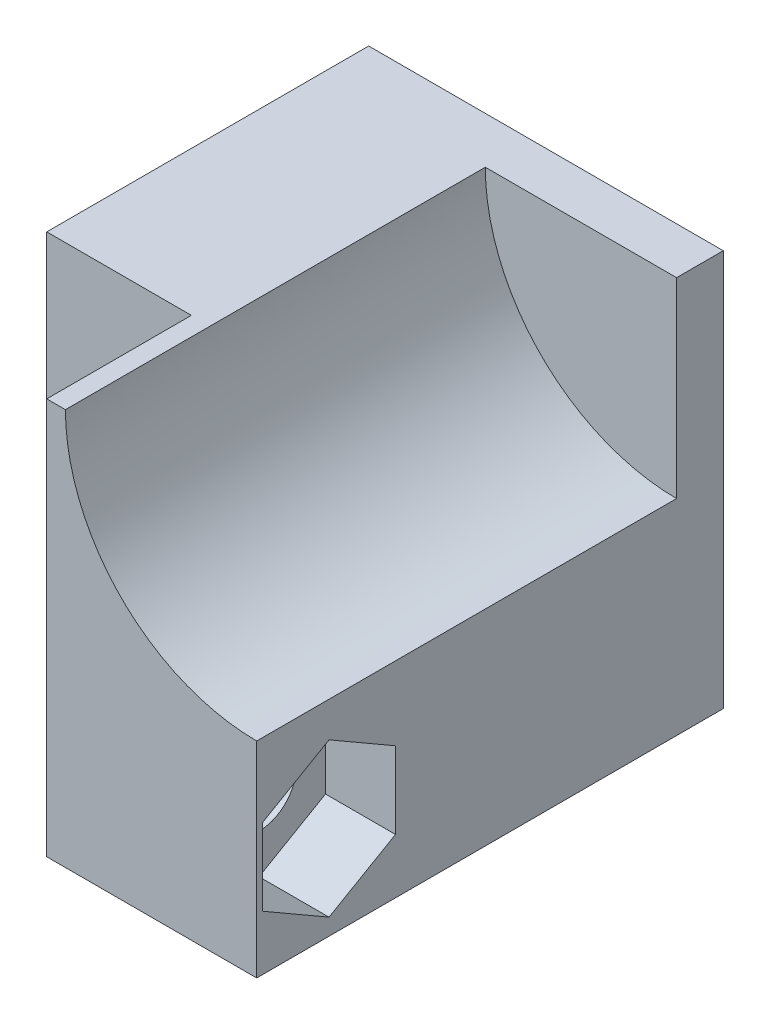
ISO-10303-21;
HEADER;
FILE_DESCRIPTION(('STEP AP214'),'2;1');
FILE_NAME('part.step','',(''),(''),'','','');
FILE_SCHEMA(('AUTOMOTIVE_DESIGN { 1 0 10303 214 1 1 1 1 }'));
ENDSEC;
DATA;
#1=APPLICATION_CONTEXT('core data for automotive mechanical design processes');
#2=APPLICATION_PROTOCOL_DEFINITION('international standard','automotive_design',2000,#1);
#3=PRODUCT_CONTEXT('',#1,'mechanical');
#4=PRODUCT('Part','Part','',(#3));
#5=PRODUCT_RELATED_PRODUCT_CATEGORY('part','',(#4));
#6=PRODUCT_DEFINITION_FORMATION('','',#4);
#7=PRODUCT_DEFINITION_CONTEXT('part definition',#1,'design');
#8=PRODUCT_DEFINITION('design','',#6,#7);
#9=PRODUCT_DEFINITION_SHAPE('','',#8);
#10=(LENGTH_UNIT() NAMED_UNIT(*) SI_UNIT(.MILLI.,.METRE.));
#11=(NAMED_UNIT(*) PLANE_ANGLE_UNIT() SI_UNIT($,.RADIAN.));
#12=(NAMED_UNIT(*) SI_UNIT($,.STERADIAN.) SOLID_ANGLE_UNIT());
#13=UNCERTAINTY_MEASURE_WITH_UNIT(LENGTH_MEASURE(1.E-05),#10,'distance_accuracy_value','');
#14=(GEOMETRIC_REPRESENTATION_CONTEXT(3) GLOBAL_UNCERTAINTY_ASSIGNED_CONTEXT((#13)) GLOBAL_UNIT_ASSIGNED_CONTEXT((#10,
#11,#12)) REPRESENTATION_CONTEXT('',''));
#15=CARTESIAN_POINT('',(0.,0.,0.));
#16=DIRECTION('',(0.,0.,1.));
#17=DIRECTION('',(1.,0.,0.));
#18=AXIS2_PLACEMENT_3D('',#15,#16,#17);
#19=CARTESIAN_POINT('',(15.20105,4.,16.9));
#20=DIRECTION('',(-1.,0.,0.));
#21=DIRECTION('',(0.,-1.,0.));
#22=AXIS2_PLACEMENT_3D('',#19,#20,#21);
#23=CYLINDRICAL_SURFACE('',#22,1.6);
#24=CARTESIAN_POINT('',(6.2,4.,16.9));
#25=DIRECTION('',(-1.,0.,0.));
#26=DIRECTION('',(0.,-1.,0.));
#27=AXIS2_PLACEMENT_3D('',#24,#25,#26);
#28=CIRCLE('',#27,1.6);
#29=CARTESIAN_POINT('',(6.2,2.4,16.9));
#30=VERTEX_POINT('',#29);
#31=EDGE_CURVE('E190',#30,#30,#28,.T.);
#32=ORIENTED_EDGE('',*,*,#31,.T.);
#33=EDGE_LOOP('',(#32));
#34=FACE_BOUND('',#33,.T.);
#35=CARTESIAN_POINT('',(12.2,4.,16.9));
#36=DIRECTION('',(1.,0.,0.));
#37=DIRECTION('',(0.,0.,-1.));
#38=AXIS2_PLACEMENT_3D('',#35,#36,#37);
#39=CIRCLE('',#38,1.6);
#40=CARTESIAN_POINT('',(12.2,4.,15.3));
#41=VERTEX_POINT('',#40);
#42=EDGE_CURVE('E36',#41,#41,#39,.F.);
#43=ORIENTED_EDGE('',*,*,#42,.F.);
#44=EDGE_LOOP('',(#43));
#45=FACE_BOUND('',#44,.T.);
#46=ADVANCED_FACE('F32',(#34,#45),#23,.F.);
#47=CARTESIAN_POINT('',(0.,17.,2.));
#48=DIRECTION('',(0.,0.,-1.));
#49=DIRECTION('',(-1.,0.,0.));
#50=AXIS2_PLACEMENT_3D('',#47,#48,#49);
#51=PLANE('',#50);
#52=CARTESIAN_POINT('',(15.2,17.,2.));
#53=DIRECTION('',(0.,0.,-1.));
#54=DIRECTION('',(1.,0.,0.));
#55=AXIS2_PLACEMENT_3D('',#52,#53,#54);
#56=CIRCLE('',#55,8.2);
#57=CARTESIAN_POINT('',(15.2,8.8,2.));
#58=VERTEX_POINT('',#57);
#59=CARTESIAN_POINT('',(7.,17.,2.));
#60=VERTEX_POINT('',#59);
#61=EDGE_CURVE('E223',#58,#60,#56,.T.);
#62=ORIENTED_EDGE('',*,*,#61,.F.);
#63=DIRECTION('',(0.,1.,0.));
#64=VECTOR('',#63,1.);
#65=CARTESIAN_POINT('',(15.2,0.,2.));
#66=LINE('',#65,#64);
#67=CARTESIAN_POINT('',(15.2,17.,2.));
#68=VERTEX_POINT('',#67);
#69=EDGE_CURVE('E249',#58,#68,#66,.T.);
#70=ORIENTED_EDGE('',*,*,#69,.T.);
#71=DIRECTION('',(-1.,0.,0.));
#72=VECTOR('',#71,1.);
#73=CARTESIAN_POINT('',(0.,17.,2.));
#74=LINE('',#73,#72);
#75=EDGE_CURVE('E238',#68,#60,#74,.T.);
#76=ORIENTED_EDGE('',*,*,#75,.T.);
#77=EDGE_LOOP('',(#62,#70,#76));
#78=FACE_BOUND('',#77,.T.);
#79=ADVANCED_FACE('F310',(#78),#51,.F.);
#80=CARTESIAN_POINT('',(0.,0.,2.));
#81=DIRECTION('',(1.,0.,0.));
#82=DIRECTION('',(0.,1.,0.));
#83=AXIS2_PLACEMENT_3D('',#80,#81,#82);
#84=PLANE('',#83);
#85=DIRECTION('',(0.,-1.,0.));
#86=VECTOR('',#85,1.);
#87=CARTESIAN_POINT('',(0.,0.,0.));
#88=LINE('',#87,#86);
#89=CARTESIAN_POINT('',(0.,17.,0.));
#90=VERTEX_POINT('',#89);
#91=CARTESIAN_POINT('',(0.,0.,0.));
#92=VERTEX_POINT('',#91);
#93=EDGE_CURVE('E264',#90,#92,#88,.T.);
#94=ORIENTED_EDGE('',*,*,#93,.T.);
#95=DIRECTION('',(0.,0.,-1.));
#96=VECTOR('',#95,1.);
#97=CARTESIAN_POINT('',(0.,0.,2.));
#98=LINE('',#97,#96);
#99=CARTESIAN_POINT('',(0.,0.,13.8));
#100=VERTEX_POINT('',#99);
#101=EDGE_CURVE('E11',#100,#92,#98,.T.);
#102=ORIENTED_EDGE('',*,*,#101,.F.);
#103=DIRECTION('',(0.,-1.,0.));
#104=VECTOR('',#103,1.);
#105=CARTESIAN_POINT('',(0.,17.,13.8));
#106=LINE('',#105,#104);
#107=CARTESIAN_POINT('',(0.,17.,13.8));
#108=VERTEX_POINT('',#107);
#109=EDGE_CURVE('E234',#108,#100,#106,.T.);
#110=ORIENTED_EDGE('',*,*,#109,.F.);
#111=DIRECTION('',(0.,0.,-1.));
#112=VECTOR('',#111,1.);
#113=CARTESIAN_POINT('',(0.,17.,2.));
#114=LINE('',#113,#112);
#115=EDGE_CURVE('E257',#108,#90,#114,.T.);
#116=ORIENTED_EDGE('',*,*,#115,.T.);
#117=EDGE_LOOP('',(#94,#102,#110,#116));
#118=FACE_BOUND('',#117,.T.);
#119=ADVANCED_FACE('F34',(#118),#84,.F.);
#120=CARTESIAN_POINT('',(0.,0.,2.));
#121=DIRECTION('',(0.,1.,0.));
#122=DIRECTION('',(0.,0.,1.));
#123=AXIS2_PLACEMENT_3D('',#120,#121,#122);
#124=PLANE('',#123);
#125=DIRECTION('',(1.,0.,0.));
#126=VECTOR('',#125,1.);
#127=CARTESIAN_POINT('',(0.,0.,0.));
#128=LINE('',#127,#126);
#129=CARTESIAN_POINT('',(15.2,0.,0.));
#130=VERTEX_POINT('',#129);
#131=EDGE_CURVE('E263',#92,#130,#128,.T.);
#132=ORIENTED_EDGE('',*,*,#131,.T.);
#133=DIRECTION('',(0.,0.,-1.));
#134=VECTOR('',#133,1.);
#135=CARTESIAN_POINT('',(15.2,0.,2.));
#136=LINE('',#135,#134);
#137=CARTESIAN_POINT('',(15.2,0.,20.));
#138=VERTEX_POINT('',#137);
#139=EDGE_CURVE('E41',#138,#130,#136,.T.);
#140=ORIENTED_EDGE('',*,*,#139,.F.);
#141=DIRECTION('',(1.,0.,0.));
#142=VECTOR('',#141,1.);
#143=CARTESIAN_POINT('',(6.2,0.,20.));
#144=LINE('',#143,#142);
#145=CARTESIAN_POINT('',(6.2,0.,20.));
#146=VERTEX_POINT('',#145);
#147=EDGE_CURVE('E200',#146,#138,#144,.T.);
#148=ORIENTED_EDGE('',*,*,#147,.F.);
#149=DIRECTION('',(0.,0.,-1.));
#150=VECTOR('',#149,1.);
#151=CARTESIAN_POINT('',(6.2,0.,20.));
#152=LINE('',#151,#150);
#153=CARTESIAN_POINT('',(6.2,0.,13.8));
#154=VERTEX_POINT('',#153);
#155=EDGE_CURVE('E206',#146,#154,#152,.T.);
#156=ORIENTED_EDGE('',*,*,#155,.T.);
#157=DIRECTION('',(1.,0.,0.));
#158=VECTOR('',#157,1.);
#159=CARTESIAN_POINT('',(0.,0.,13.8));
#160=LINE('',#159,#158);
#161=EDGE_CURVE('E214',#100,#154,#160,.T.);
#162=ORIENTED_EDGE('',*,*,#161,.F.);
#163=ORIENTED_EDGE('',*,*,#101,.T.);
#164=EDGE_LOOP('',(#132,#140,#148,#156,#162,#163));
#165=FACE_BOUND('',#164,.T.);
#166=ADVANCED_FACE('F283',(#165),#124,.F.);
#167=CARTESIAN_POINT('',(15.2,0.,2.));
#168=DIRECTION('',(-1.,0.,0.));
#169=DIRECTION('',(0.,-1.,0.));
#170=AXIS2_PLACEMENT_3D('',#167,#168,#169);
#171=PLANE('',#170);
#172=DIRECTION('',(0.,0.5,-0.866025403784438));
#173=VECTOR('',#172,1.);
#174=CARTESIAN_POINT('',(15.2,0.709103465619134,16.9));
#175=LINE('',#174,#173);
#176=CARTESIAN_POINT('',(15.2,0.709103465619135,16.9));
#177=VERTEX_POINT('',#176);
#178=CARTESIAN_POINT('',(15.2,2.35455173280957,14.05));
#179=VERTEX_POINT('',#178);
#180=EDGE_CURVE('E171',#177,#179,#175,.T.);
#181=ORIENTED_EDGE('',*,*,#180,.F.);
#182=DIRECTION('',(0.,-0.499999999999999,-0.866025403784439));
#183=VECTOR('',#182,1.);
#184=CARTESIAN_POINT('',(15.2,2.35455173280956,19.75));
#185=LINE('',#184,#183);
#186=CARTESIAN_POINT('',(15.2,2.35455173280956,19.75));
#187=VERTEX_POINT('',#186);
#188=EDGE_CURVE('E49',#187,#177,#185,.T.);
#189=ORIENTED_EDGE('',*,*,#188,.F.);
#190=DIRECTION('',(0.,-1.,0.));
#191=VECTOR('',#190,1.);
#192=CARTESIAN_POINT('',(15.2,5.64544826719043,19.75));
#193=LINE('',#192,#191);
#194=CARTESIAN_POINT('',(15.2,5.64544826719043,19.75));
#195=VERTEX_POINT('',#194);
#196=EDGE_CURVE('E157',#195,#187,#193,.T.);
#197=ORIENTED_EDGE('',*,*,#196,.F.);
#198=DIRECTION('',(0.,-0.5,0.866025403784438));
#199=VECTOR('',#198,1.);
#200=CARTESIAN_POINT('',(15.2,7.29089653438087,16.9));
#201=LINE('',#200,#199);
#202=CARTESIAN_POINT('',(15.2,7.29089653438087,16.9));
#203=VERTEX_POINT('',#202);
#204=EDGE_CURVE('E160',#203,#195,#201,.T.);
#205=ORIENTED_EDGE('',*,*,#204,.F.);
#206=DIRECTION('',(0.,0.5,0.866025403784439));
#207=VECTOR('',#206,1.);
#208=CARTESIAN_POINT('',(15.2,5.64544826719043,14.05));
#209=LINE('',#208,#207);
#210=CARTESIAN_POINT('',(15.2,5.64544826719043,14.05));
#211=VERTEX_POINT('',#210);
#212=EDGE_CURVE('E176',#211,#203,#209,.T.);
#213=ORIENTED_EDGE('',*,*,#212,.F.);
#214=DIRECTION('',(0.,1.,0.));
#215=VECTOR('',#214,1.);
#216=CARTESIAN_POINT('',(15.2,2.35455173280957,14.05));
#217=LINE('',#216,#215);
#218=EDGE_CURVE('E173',#179,#211,#217,.T.);
#219=ORIENTED_EDGE('',*,*,#218,.F.);
#220=EDGE_LOOP('',(#181,#189,#197,#205,#213,#219));
#221=FACE_BOUND('',#220,.T.);
#222=DIRECTION('',(0.,1.,0.));
#223=VECTOR('',#222,1.);
#224=CARTESIAN_POINT('',(15.2,0.,0.));
#225=LINE('',#224,#223);
#226=CARTESIAN_POINT('',(15.2,17.,0.));
#227=VERTEX_POINT('',#226);
#228=EDGE_CURVE('E261',#130,#227,#225,.T.);
#229=ORIENTED_EDGE('',*,*,#228,.T.);
#230=DIRECTION('',(0.,0.,-1.));
#231=VECTOR('',#230,1.);
#232=CARTESIAN_POINT('',(15.2,17.,2.));
#233=LINE('',#232,#231);
#234=EDGE_CURVE('E254',#68,#227,#233,.T.);
#235=ORIENTED_EDGE('',*,*,#234,.F.);
#236=ORIENTED_EDGE('',*,*,#69,.F.);
#237=DIRECTION('',(0.,0.,-1.));
#238=VECTOR('',#237,1.);
#239=CARTESIAN_POINT('',(15.2,8.8,13.8));
#240=LINE('',#239,#238);
#241=CARTESIAN_POINT('',(15.2,8.8,20.));
#242=VERTEX_POINT('',#241);
#243=EDGE_CURVE('E266',#242,#58,#240,.T.);
#244=ORIENTED_EDGE('',*,*,#243,.F.);
#245=DIRECTION('',(0.,1.,0.));
#246=VECTOR('',#245,1.);
#247=CARTESIAN_POINT('',(15.2,0.,20.));
#248=LINE('',#247,#246);
#249=EDGE_CURVE('E203',#138,#242,#248,.T.);
#250=ORIENTED_EDGE('',*,*,#249,.F.);
#251=ORIENTED_EDGE('',*,*,#139,.T.);
#252=EDGE_LOOP('',(#229,#235,#236,#244,#250,#251));
#253=FACE_BOUND('',#252,.T.);
#254=ADVANCED_FACE('F296',(#221,#253),#171,.F.);
#255=CARTESIAN_POINT('',(0.,17.,2.));
#256=DIRECTION('',(0.,-1.,0.));
#257=DIRECTION('',(0.,0.,-1.));
#258=AXIS2_PLACEMENT_3D('',#255,#256,#257);
#259=PLANE('',#258);
#260=DIRECTION('',(-1.,0.,0.));
#261=VECTOR('',#260,1.);
#262=CARTESIAN_POINT('',(0.,17.,0.));
#263=LINE('',#262,#261);
#264=EDGE_CURVE('E250',#227,#90,#263,.T.);
#265=ORIENTED_EDGE('',*,*,#264,.T.);
#266=ORIENTED_EDGE('',*,*,#115,.F.);
#267=DIRECTION('',(-1.,0.,0.));
#268=VECTOR('',#267,1.);
#269=CARTESIAN_POINT('',(7.,17.,13.8));
#270=LINE('',#269,#268);
#271=CARTESIAN_POINT('',(6.2,17.,13.8));
#272=VERTEX_POINT('',#271);
#273=EDGE_CURVE('E229',#272,#108,#270,.T.);
#274=ORIENTED_EDGE('',*,*,#273,.F.);
#275=DIRECTION('',(0.,0.,-1.));
#276=VECTOR('',#275,1.);
#277=CARTESIAN_POINT('',(6.2,17.,20.));
#278=LINE('',#277,#276);
#279=CARTESIAN_POINT('',(6.2,17.,20.));
#280=VERTEX_POINT('',#279);
#281=EDGE_CURVE('E219',#280,#272,#278,.T.);
#282=ORIENTED_EDGE('',*,*,#281,.F.);
#283=DIRECTION('',(-1.,0.,0.));
#284=VECTOR('',#283,1.);
#285=CARTESIAN_POINT('',(7.,17.,20.));
#286=LINE('',#285,#284);
#287=CARTESIAN_POINT('',(7.,17.,20.));
#288=VERTEX_POINT('',#287);
#289=EDGE_CURVE('E196',#288,#280,#286,.T.);
#290=ORIENTED_EDGE('',*,*,#289,.F.);
#291=DIRECTION('',(0.,0.,-1.));
#292=VECTOR('',#291,1.);
#293=CARTESIAN_POINT('',(7.,17.,13.8));
#294=LINE('',#293,#292);
#295=EDGE_CURVE('E241',#288,#60,#294,.T.);
#296=ORIENTED_EDGE('',*,*,#295,.T.);
#297=ORIENTED_EDGE('',*,*,#75,.F.);
#298=ORIENTED_EDGE('',*,*,#234,.T.);
#299=EDGE_LOOP('',(#265,#266,#274,#282,#290,#296,#297,#298));
#300=FACE_BOUND('',#299,.T.);
#301=ADVANCED_FACE('F290',(#300),#259,.F.);
#302=CARTESIAN_POINT('',(0.,17.,0.));
#303=DIRECTION('',(0.,0.,-1.));
#304=DIRECTION('',(-1.,0.,0.));
#305=AXIS2_PLACEMENT_3D('',#302,#303,#304);
#306=PLANE('',#305);
#307=ORIENTED_EDGE('',*,*,#93,.F.);
#308=ORIENTED_EDGE('',*,*,#264,.F.);
#309=ORIENTED_EDGE('',*,*,#228,.F.);
#310=ORIENTED_EDGE('',*,*,#131,.F.);
#311=EDGE_LOOP('',(#307,#308,#309,#310));
#312=FACE_BOUND('',#311,.T.);
#313=ADVANCED_FACE('F293',(#312),#306,.T.);
#314=CARTESIAN_POINT('',(15.2,17.,13.8));
#315=DIRECTION('',(0.,0.,-1.));
#316=DIRECTION('',(-1.,0.,0.));
#317=AXIS2_PLACEMENT_3D('',#314,#315,#316);
#318=CYLINDRICAL_SURFACE('',#317,8.2);
#319=ORIENTED_EDGE('',*,*,#61,.T.);
#320=ORIENTED_EDGE('',*,*,#295,.F.);
#321=CARTESIAN_POINT('',(15.2,17.,20.));
#322=DIRECTION('',(0.,0.,-1.));
#323=DIRECTION('',(1.,0.,0.));
#324=AXIS2_PLACEMENT_3D('',#321,#322,#323);
#325=CIRCLE('',#324,8.2);
#326=EDGE_CURVE('E193',#242,#288,#325,.T.);
#327=ORIENTED_EDGE('',*,*,#326,.F.);
#328=ORIENTED_EDGE('',*,*,#243,.T.);
#329=EDGE_LOOP('',(#319,#320,#327,#328));
#330=FACE_BOUND('',#329,.T.);
#331=ADVANCED_FACE('F299',(#330),#318,.F.);
#332=CARTESIAN_POINT('',(15.2,17.,13.8));
#333=DIRECTION('',(0.,0.,1.));
#334=DIRECTION('',(1.,0.,0.));
#335=AXIS2_PLACEMENT_3D('',#332,#333,#334);
#336=PLANE('',#335);
#337=DIRECTION('',(0.,-1.,0.));
#338=VECTOR('',#337,1.);
#339=CARTESIAN_POINT('',(6.2,17.,13.8));
#340=LINE('',#339,#338);
#341=EDGE_CURVE('E57',#272,#154,#340,.T.);
#342=ORIENTED_EDGE('',*,*,#341,.F.);
#343=ORIENTED_EDGE('',*,*,#273,.T.);
#344=ORIENTED_EDGE('',*,*,#109,.T.);
#345=ORIENTED_EDGE('',*,*,#161,.T.);
#346=EDGE_LOOP('',(#342,#343,#344,#345));
#347=FACE_BOUND('',#346,.T.);
#348=ADVANCED_FACE('F280',(#347),#336,.T.);
#349=CARTESIAN_POINT('',(6.2,17.,20.));
#350=DIRECTION('',(1.,0.,0.));
#351=DIRECTION('',(0.,1.,0.));
#352=AXIS2_PLACEMENT_3D('',#349,#350,#351);
#353=PLANE('',#352);
#354=ORIENTED_EDGE('',*,*,#31,.F.);
#355=EDGE_LOOP('',(#354));
#356=FACE_BOUND('',#355,.T.);
#357=ORIENTED_EDGE('',*,*,#341,.T.);
#358=ORIENTED_EDGE('',*,*,#155,.F.);
#359=DIRECTION('',(0.,-1.,0.));
#360=VECTOR('',#359,1.);
#361=CARTESIAN_POINT('',(6.2,17.,20.));
#362=LINE('',#361,#360);
#363=EDGE_CURVE('E198',#280,#146,#362,.T.);
#364=ORIENTED_EDGE('',*,*,#363,.F.);
#365=ORIENTED_EDGE('',*,*,#281,.T.);
#366=EDGE_LOOP('',(#357,#358,#364,#365));
#367=FACE_BOUND('',#366,.T.);
#368=ADVANCED_FACE('F286',(#356,#367),#353,.F.);
#369=CARTESIAN_POINT('',(15.2,17.,20.));
#370=DIRECTION('',(0.,0.,1.));
#371=DIRECTION('',(1.,0.,0.));
#372=AXIS2_PLACEMENT_3D('',#369,#370,#371);
#373=PLANE('',#372);
#374=ORIENTED_EDGE('',*,*,#326,.T.);
#375=ORIENTED_EDGE('',*,*,#289,.T.);
#376=ORIENTED_EDGE('',*,*,#363,.T.);
#377=ORIENTED_EDGE('',*,*,#147,.T.);
#378=ORIENTED_EDGE('',*,*,#249,.T.);
#379=EDGE_LOOP('',(#374,#375,#376,#377,#378));
#380=FACE_BOUND('',#379,.T.);
#381=ADVANCED_FACE('F288',(#380),#373,.T.);
#382=CARTESIAN_POINT('',(12.2,0.709103465619133,16.9));
#383=DIRECTION('',(1.,0.,0.));
#384=DIRECTION('',(0.,0.,-1.));
#385=AXIS2_PLACEMENT_3D('',#382,#383,#384);
#386=PLANE('',#385);
#387=DIRECTION('',(0.,-0.499999999999999,-0.866025403784439));
#388=VECTOR('',#387,1.);
#389=CARTESIAN_POINT('',(12.2,2.35455173280956,19.75));
#390=LINE('',#389,#388);
#391=CARTESIAN_POINT('',(12.2,2.35455173280956,19.75));
#392=VERTEX_POINT('',#391);
#393=CARTESIAN_POINT('',(12.2,0.709103465619133,16.9));
#394=VERTEX_POINT('',#393);
#395=EDGE_CURVE('E137',#392,#394,#390,.T.);
#396=ORIENTED_EDGE('',*,*,#395,.T.);
#397=DIRECTION('',(0.,0.5,-0.866025403784438));
#398=VECTOR('',#397,1.);
#399=CARTESIAN_POINT('',(12.2,0.709103465619133,16.9));
#400=LINE('',#399,#398);
#401=CARTESIAN_POINT('',(12.2,2.35455173280957,14.05));
#402=VERTEX_POINT('',#401);
#403=EDGE_CURVE('E146',#394,#402,#400,.T.);
#404=ORIENTED_EDGE('',*,*,#403,.T.);
#405=DIRECTION('',(0.,1.,0.));
#406=VECTOR('',#405,1.);
#407=CARTESIAN_POINT('',(12.2,2.35455173280957,14.05));
#408=LINE('',#407,#406);
#409=CARTESIAN_POINT('',(12.2,5.64544826719043,14.05));
#410=VERTEX_POINT('',#409);
#411=EDGE_CURVE('E151',#402,#410,#408,.T.);
#412=ORIENTED_EDGE('',*,*,#411,.T.);
#413=DIRECTION('',(0.,0.5,0.866025403784439));
#414=VECTOR('',#413,1.);
#415=CARTESIAN_POINT('',(12.2,5.64544826719043,14.05));
#416=LINE('',#415,#414);
#417=CARTESIAN_POINT('',(12.2,7.29089653438087,16.9));
#418=VERTEX_POINT('',#417);
#419=EDGE_CURVE('E164',#410,#418,#416,.T.);
#420=ORIENTED_EDGE('',*,*,#419,.T.);
#421=DIRECTION('',(0.,-0.5,0.866025403784438));
#422=VECTOR('',#421,1.);
#423=CARTESIAN_POINT('',(12.2,7.29089653438087,16.9));
#424=LINE('',#423,#422);
#425=CARTESIAN_POINT('',(12.2,5.64544826719043,19.75));
#426=VERTEX_POINT('',#425);
#427=EDGE_CURVE('E167',#418,#426,#424,.T.);
#428=ORIENTED_EDGE('',*,*,#427,.T.);
#429=DIRECTION('',(0.,-1.,0.));
#430=VECTOR('',#429,1.);
#431=CARTESIAN_POINT('',(12.2,5.64544826719043,19.75));
#432=LINE('',#431,#430);
#433=EDGE_CURVE('E143',#426,#392,#432,.T.);
#434=ORIENTED_EDGE('',*,*,#433,.T.);
#435=EDGE_LOOP('',(#396,#404,#412,#420,#428,#434));
#436=FACE_BOUND('',#435,.T.);
#437=ORIENTED_EDGE('',*,*,#42,.T.);
#438=EDGE_LOOP('',(#437));
#439=FACE_BOUND('',#438,.T.);
#440=ADVANCED_FACE('F153',(#436,#439),#386,.T.);
#441=CARTESIAN_POINT('',(12.2,2.35455173280956,19.75));
#442=DIRECTION('',(0.,-0.866025403784439,0.5));
#443=DIRECTION('',(0.,-0.5,-0.866025403784439));
#444=AXIS2_PLACEMENT_3D('',#441,#442,#443);
#445=PLANE('',#444);
#446=ORIENTED_EDGE('',*,*,#188,.T.);
#447=DIRECTION('',(1.,0.,0.));
#448=VECTOR('',#447,1.);
#449=CARTESIAN_POINT('',(12.2,0.709103465619133,16.9));
#450=LINE('',#449,#448);
#451=EDGE_CURVE('E133',#394,#177,#450,.T.);
#452=ORIENTED_EDGE('',*,*,#451,.F.);
#453=ORIENTED_EDGE('',*,*,#395,.F.);
#454=DIRECTION('',(1.,0.,0.));
#455=VECTOR('',#454,1.);
#456=CARTESIAN_POINT('',(12.2,2.35455173280956,19.75));
#457=LINE('',#456,#455);
#458=EDGE_CURVE('E181',#392,#187,#457,.T.);
#459=ORIENTED_EDGE('',*,*,#458,.T.);
#460=EDGE_LOOP('',(#446,#452,#453,#459));
#461=FACE_BOUND('',#460,.T.);
#462=ADVANCED_FACE('F135',(#461),#445,.F.);
#463=CARTESIAN_POINT('',(12.2,5.64544826719043,19.75));
#464=DIRECTION('',(0.,0.,1.));
#465=DIRECTION('',(1.,0.,0.));
#466=AXIS2_PLACEMENT_3D('',#463,#464,#465);
#467=PLANE('',#466);
#468=ORIENTED_EDGE('',*,*,#196,.T.);
#469=ORIENTED_EDGE('',*,*,#458,.F.);
#470=ORIENTED_EDGE('',*,*,#433,.F.);
#471=DIRECTION('',(1.,0.,0.));
#472=VECTOR('',#471,1.);
#473=CARTESIAN_POINT('',(12.2,5.64544826719043,19.75));
#474=LINE('',#473,#472);
#475=EDGE_CURVE('E183',#426,#195,#474,.T.);
#476=ORIENTED_EDGE('',*,*,#475,.T.);
#477=EDGE_LOOP('',(#468,#469,#470,#476));
#478=FACE_BOUND('',#477,.T.);
#479=ADVANCED_FACE('F347',(#478),#467,.F.);
#480=CARTESIAN_POINT('',(12.2,7.29089653438087,16.9));
#481=DIRECTION('',(0.,0.866025403784438,0.500000000000001));
#482=DIRECTION('',(0.,-0.500000000000001,0.866025403784438));
#483=AXIS2_PLACEMENT_3D('',#480,#481,#482);
#484=PLANE('',#483);
#485=ORIENTED_EDGE('',*,*,#204,.T.);
#486=ORIENTED_EDGE('',*,*,#475,.F.);
#487=ORIENTED_EDGE('',*,*,#427,.F.);
#488=DIRECTION('',(1.,0.,0.));
#489=VECTOR('',#488,1.);
#490=CARTESIAN_POINT('',(12.2,7.29089653438087,16.9));
#491=LINE('',#490,#489);
#492=EDGE_CURVE('E185',#418,#203,#491,.T.);
#493=ORIENTED_EDGE('',*,*,#492,.T.);
#494=EDGE_LOOP('',(#485,#486,#487,#493));
#495=FACE_BOUND('',#494,.T.);
#496=ADVANCED_FACE('F353',(#495),#484,.F.);
#497=CARTESIAN_POINT('',(12.2,5.64544826719043,14.05));
#498=DIRECTION('',(0.,0.866025403784439,-0.5));
#499=DIRECTION('',(0.,0.5,0.866025403784439));
#500=AXIS2_PLACEMENT_3D('',#497,#498,#499);
#501=PLANE('',#500);
#502=ORIENTED_EDGE('',*,*,#212,.T.);
#503=ORIENTED_EDGE('',*,*,#492,.F.);
#504=ORIENTED_EDGE('',*,*,#419,.F.);
#505=DIRECTION('',(1.,0.,0.));
#506=VECTOR('',#505,1.);
#507=CARTESIAN_POINT('',(12.2,5.64544826719043,14.05));
#508=LINE('',#507,#506);
#509=EDGE_CURVE('E187',#410,#211,#508,.T.);
#510=ORIENTED_EDGE('',*,*,#509,.T.);
#511=EDGE_LOOP('',(#502,#503,#504,#510));
#512=FACE_BOUND('',#511,.T.);
#513=ADVANCED_FACE('F361',(#512),#501,.F.);
#514=CARTESIAN_POINT('',(12.2,2.35455173280957,14.05));
#515=DIRECTION('',(0.,0.,-1.));
#516=DIRECTION('',(-1.,0.,0.));
#517=AXIS2_PLACEMENT_3D('',#514,#515,#516);
#518=PLANE('',#517);
#519=ORIENTED_EDGE('',*,*,#218,.T.);
#520=ORIENTED_EDGE('',*,*,#509,.F.);
#521=ORIENTED_EDGE('',*,*,#411,.F.);
#522=DIRECTION('',(1.,0.,0.));
#523=VECTOR('',#522,1.);
#524=CARTESIAN_POINT('',(12.2,2.35455173280957,14.05));
#525=LINE('',#524,#523);
#526=EDGE_CURVE('E142',#402,#179,#525,.T.);
#527=ORIENTED_EDGE('',*,*,#526,.T.);
#528=EDGE_LOOP('',(#519,#520,#521,#527));
#529=FACE_BOUND('',#528,.T.);
#530=ADVANCED_FACE('F369',(#529),#518,.F.);
#531=CARTESIAN_POINT('',(12.2,0.709103465619133,16.9));
#532=DIRECTION('',(0.,-0.866025403784438,-0.5));
#533=DIRECTION('',(0.,0.5,-0.866025403784438));
#534=AXIS2_PLACEMENT_3D('',#531,#532,#533);
#535=PLANE('',#534);
#536=ORIENTED_EDGE('',*,*,#180,.T.);
#537=ORIENTED_EDGE('',*,*,#526,.F.);
#538=ORIENTED_EDGE('',*,*,#403,.F.);
#539=ORIENTED_EDGE('',*,*,#451,.T.);
#540=EDGE_LOOP('',(#536,#537,#538,#539));
#541=FACE_BOUND('',#540,.T.);
#542=ADVANCED_FACE('F147',(#541),#535,.F.);
#543=CLOSED_SHELL('',(#46,#79,#119,#166,#254,#301,#313,#331,#348,#368,#381,#440,#462,#479,#496,
#513,#530,#542));
#544=MANIFOLD_SOLID_BREP('B2',#543);
#545=ADVANCED_BREP_SHAPE_REPRESENTATION('',(#18,#544),#14);
#546=SHAPE_DEFINITION_REPRESENTATION(#9,#545);
ENDSEC;
END-ISO-10303-21;
